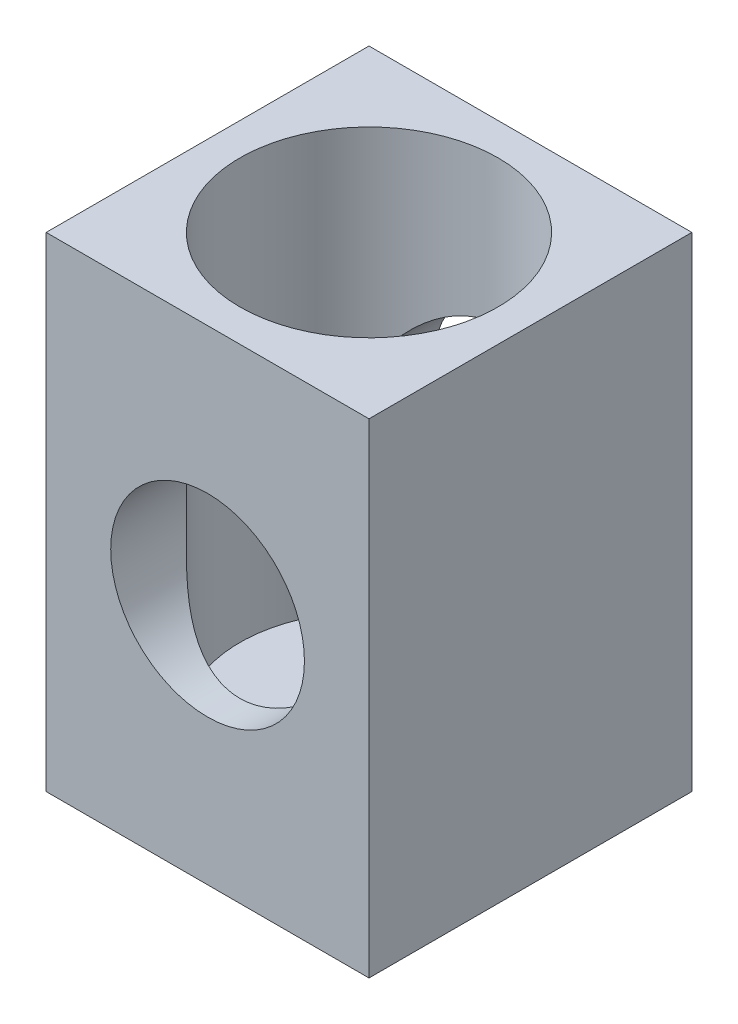
ISO-10303-21;
HEADER;
FILE_DESCRIPTION(('STEP AP214'),'2;1');
FILE_NAME('part.step','',(''),(''),'','','');
FILE_SCHEMA(('AUTOMOTIVE_DESIGN { 1 0 10303 214 1 1 1 1 }'));
ENDSEC;
DATA;
#1=APPLICATION_CONTEXT('core data for automotive mechanical design processes');
#2=APPLICATION_PROTOCOL_DEFINITION('international standard','automotive_design',2000,#1);
#3=PRODUCT_CONTEXT('',#1,'mechanical');
#4=PRODUCT('Part','Part','',(#3));
#5=PRODUCT_RELATED_PRODUCT_CATEGORY('part','',(#4));
#6=PRODUCT_DEFINITION_FORMATION('','',#4);
#7=PRODUCT_DEFINITION_CONTEXT('part definition',#1,'design');
#8=PRODUCT_DEFINITION('design','',#6,#7);
#9=PRODUCT_DEFINITION_SHAPE('','',#8);
#10=(LENGTH_UNIT() NAMED_UNIT(*) SI_UNIT(.MILLI.,.METRE.));
#11=(NAMED_UNIT(*) PLANE_ANGLE_UNIT() SI_UNIT($,.RADIAN.));
#12=(NAMED_UNIT(*) SI_UNIT($,.STERADIAN.) SOLID_ANGLE_UNIT());
#13=UNCERTAINTY_MEASURE_WITH_UNIT(LENGTH_MEASURE(1.E-05),#10,'distance_accuracy_value','');
#14=(GEOMETRIC_REPRESENTATION_CONTEXT(3) GLOBAL_UNCERTAINTY_ASSIGNED_CONTEXT((#13)) GLOBAL_UNIT_ASSIGNED_CONTEXT((#10,
#11,#12)) REPRESENTATION_CONTEXT('',''));
#15=CARTESIAN_POINT('',(0.,0.,0.));
#16=DIRECTION('',(0.,0.,1.));
#17=DIRECTION('',(1.,0.,0.));
#18=AXIS2_PLACEMENT_3D('',#15,#16,#17);
#19=CARTESIAN_POINT('',(0.,0.,10.));
#20=DIRECTION('',(0.,0.,-1.));
#21=DIRECTION('',(-1.,0.,0.));
#22=AXIS2_PLACEMENT_3D('',#19,#20,#21);
#23=CYLINDRICAL_SURFACE('',#22,3.);
#24=CARTESIAN_POINT('',(-3.,0.,7.64575131106459));
#25=CARTESIAN_POINT('',(-3.00000280896557,-0.0700400109545899,7.645745510217));
#26=CARTESIAN_POINT('',(-2.99754094962657,-0.140057631563114,7.64854755685349));
#27=CARTESIAN_POINT('',(-2.98778335234161,-0.279338367039745,7.65954937326353));
#28=CARTESIAN_POINT('',(-2.98048600162194,-0.348601222335317,7.6677509439258));
#29=CARTESIAN_POINT('',(-2.95155901854998,-0.554512621260734,7.69984445943127));
#30=CARTESIAN_POINT('',(-2.92289529116371,-0.689073945480057,7.7312230381533));
#31=CARTESIAN_POINT('',(-2.84967902852603,-0.947198100722388,7.80749414131084));
#32=CARTESIAN_POINT('',(-2.80535116546462,-1.0708870623472,7.85219424245675));
#33=CARTESIAN_POINT('',(-2.70261160960258,-1.30868140121693,7.94973182273596));
#34=CARTESIAN_POINT('',(-2.64420161900243,-1.42278793450775,8.0025683180905));
#35=CARTESIAN_POINT('',(-2.50080271595863,-1.66422514565906,8.12354326851478));
#36=CARTESIAN_POINT('',(-2.41280926238806,-1.78931998588241,8.19256884637289));
#37=CARTESIAN_POINT('',(-2.2186541254275,-2.02506683861348,8.33043252944683));
#38=CARTESIAN_POINT('',(-2.11246568694301,-2.13569715304193,8.3992702047211));
#39=CARTESIAN_POINT('',(-1.92836490190184,-2.30000310928588,8.50539769561968));
#40=CARTESIAN_POINT('',(-1.85597029075026,-2.35884951415949,8.54435965000119));
#41=CARTESIAN_POINT('',(-1.70504181430757,-2.47014549419953,8.6193818859952));
#42=CARTESIAN_POINT('',(-1.62651080993558,-2.52259802147264,8.6554435040806));
#43=CARTESIAN_POINT('',(-1.46370409108269,-2.62041392728754,8.72361957309374));
#44=CARTESIAN_POINT('',(-1.37943756818546,-2.66578828201937,8.75574011862965));
#45=CARTESIAN_POINT('',(-1.20559494807532,-2.74878528245246,8.81509912700353));
#46=CARTESIAN_POINT('',(-1.11602169211667,-2.78641202882129,8.84234017147395));
#47=CARTESIAN_POINT('',(-0.895799479373822,-2.86637910974201,8.90065407398259));
#48=CARTESIAN_POINT('',(-0.762908554560546,-2.90470447870669,8.92898588633408));
#49=CARTESIAN_POINT('',(-0.491088777779693,-2.96278993678961,8.97212104358515));
#50=CARTESIAN_POINT('',(-0.352165281713008,-2.9825661555359,8.98693614179333));
#51=CARTESIAN_POINT('',(-0.0717346069513397,-3.00244085765562,9.00182527262811));
#52=CARTESIAN_POINT('',(0.0697783346711364,-3.00248821011103,9.00186100185061));
#53=CARTESIAN_POINT('',(0.350633497188309,-2.98276482524305,8.9870847294994));
#54=CARTESIAN_POINT('',(0.489975207798217,-2.96298949844351,8.97226928948599));
#55=CARTESIAN_POINT('',(0.757778086122695,-2.90583772087129,8.92982740624245));
#56=CARTESIAN_POINT('',(0.886448455408856,-2.86908729937515,8.90265711426681));
#57=CARTESIAN_POINT('',(1.13536105117422,-2.78000876349667,8.83764561419608));
#58=CARTESIAN_POINT('',(1.25560143283418,-2.72767725241249,8.79980207941239));
#59=CARTESIAN_POINT('',(1.49843381849743,-2.60294075481544,8.7112209069133));
#60=CARTESIAN_POINT('',(1.61987076262548,-2.52897580274821,8.65953080871578));
#61=CARTESIAN_POINT('',(1.84913450790411,-2.36653259607667,8.54921405312389));
#62=CARTESIAN_POINT('',(1.95694957120903,-2.27804197375845,8.49058149661275));
#63=CARTESIAN_POINT('',(2.17816408331313,-2.06955330097201,8.35787531624607));
#64=CARTESIAN_POINT('',(2.28848985950528,-1.94678157961134,8.28303311698989));
#65=CARTESIAN_POINT('',(2.48801751171524,-1.68433083309214,8.13451916601302));
#66=CARTESIAN_POINT('',(2.57720932423716,-1.54464380090688,8.06084798741906));
#67=CARTESIAN_POINT('',(2.71746412822589,-1.27803625954326,7.93638851986388));
#68=CARTESIAN_POINT('',(2.77257733772077,-1.15402590973979,7.88395199558713));
#69=CARTESIAN_POINT('',(2.86638794181777,-0.895869436820915,7.79073482535992));
#70=CARTESIAN_POINT('',(2.90512243472909,-0.7617470392939,7.74992790713867));
#71=CARTESIAN_POINT('',(2.95804770816485,-0.512626113066036,7.69280101182057));
#72=CARTESIAN_POINT('',(2.97558139385094,-0.399105839376981,7.67323078916896));
#73=CARTESIAN_POINT('',(2.9974352084815,-0.169289064046268,7.6487117707326));
#74=CARTESIAN_POINT('',(3.00177224296671,-0.0529963068392494,7.64374426844221));
#75=CARTESIAN_POINT('',(2.99690541681497,0.178957970106776,7.64925736853119));
#76=CARTESIAN_POINT('',(2.98769657209908,0.29461924177816,7.6597436569903));
#77=CARTESIAN_POINT('',(2.95645049123765,0.522152354812109,7.6944244027003));
#78=CARTESIAN_POINT('',(2.93439135868922,0.634017382366582,7.71864225613374));
#79=CARTESIAN_POINT('',(2.86827946945848,0.892675833612172,7.78855502614561));
#80=CARTESIAN_POINT('',(2.81908501412404,1.03687078522466,7.83889586236445));
#81=CARTESIAN_POINT('',(2.7017763357747,1.31261645196258,7.95075783431285));
#82=CARTESIAN_POINT('',(2.6336272774567,1.44414328026578,8.01229948253767));
#83=CARTESIAN_POINT('',(2.47740025533046,1.69869361959231,8.14216325235085));
#84=CARTESIAN_POINT('',(2.38870032302784,1.82124906005961,8.21064858311596));
#85=CARTESIAN_POINT('',(2.19363312764518,2.05202089322889,8.34695922368102));
#86=CARTESIAN_POINT('',(2.08725728128943,2.16023027348304,8.41478419579483));
#87=CARTESIAN_POINT('',(1.90239818691815,2.32153213165692,8.51957077757728));
#88=CARTESIAN_POINT('',(1.82922305125998,2.37965811952592,8.55825033527664));
#89=CARTESIAN_POINT('',(1.67675777822378,2.48943814432249,8.63258399954074));
#90=CARTESIAN_POINT('',(1.59747053828961,2.54109521772846,8.66823952301725));
#91=CARTESIAN_POINT('',(1.43317795543371,2.63724136264881,8.73548722322448));
#92=CARTESIAN_POINT('',(1.34818053963821,2.68174009166811,8.76708486273611));
#93=CARTESIAN_POINT('',(1.17294532822089,2.76288334375196,8.8252747409515));
#94=CARTESIAN_POINT('',(1.08271039442741,2.7995321057078,8.85186968010572));
#95=CARTESIAN_POINT('',(0.861573588365201,2.87683946411381,8.90835673615322));
#96=CARTESIAN_POINT('',(0.7285167929003,2.91350380472521,8.93550115203699));
#97=CARTESIAN_POINT('',(0.45671226662122,2.96826736567963,8.97621371280714));
#98=CARTESIAN_POINT('',(0.317969739628316,2.98638318445571,8.98979399550191));
#99=CARTESIAN_POINT('',(0.0382996918456445,3.00303015435829,9.0022690757003));
#100=CARTESIAN_POINT('',(-0.102632185789823,3.00151533129432,9.00112939966075));
#101=CARTESIAN_POINT('',(-0.382019221764031,2.97887872098709,8.98417666975469));
#102=CARTESIAN_POINT('',(-0.520473710285136,2.9577517104191,8.96835970687872));
#103=CARTESIAN_POINT('',(-0.787043562612924,2.89804998722627,8.92406786315679));
#104=CARTESIAN_POINT('',(-0.915342390371109,2.8599995894081,8.89597377375742));
#105=CARTESIAN_POINT('',(-1.16332276886423,2.76842391672119,8.82925445361189));
#106=CARTESIAN_POINT('',(-1.28300246946203,2.71489533167846,8.7906269702888));
#107=CARTESIAN_POINT('',(-1.52509537227955,2.58744411218317,8.70035282969445));
#108=CARTESIAN_POINT('',(-1.64628246914877,2.51189814336096,8.64772704497864));
#109=CARTESIAN_POINT('',(-1.87482962773044,2.34626711280584,8.53571013069578));
#110=CARTESIAN_POINT('',(-1.98217681660196,2.25616868842546,8.47631279811072));
#111=CARTESIAN_POINT('',(-2.2022476229936,2.04398931120082,8.34212703425336));
#112=CARTESIAN_POINT('',(-2.31183387997298,1.91910738721412,8.26661834639247));
#113=CARTESIAN_POINT('',(-2.50950501943596,1.65226367003828,8.11732175300604));
#114=CARTESIAN_POINT('',(-2.59758202428158,1.51029564749765,8.04353448686307));
#115=CARTESIAN_POINT('',(-2.73391957253569,1.24223404800787,7.92099172443149));
#116=CARTESIAN_POINT('',(-2.78667101930056,1.11933187972561,7.87027147723428));
#117=CARTESIAN_POINT('',(-2.87610746935094,0.863832333692763,7.78065231320265));
#118=CARTESIAN_POINT('',(-2.91283513703737,0.731261812136979,7.74172209031511));
#119=CARTESIAN_POINT('',(-2.95994243938014,0.498428371532329,7.69064580071015));
#120=CARTESIAN_POINT('',(-2.97488911938737,0.400081361304646,7.67399401036027));
#121=CARTESIAN_POINT('',(-2.99491264524008,0.201139840614341,7.65155449367015));
#122=CARTESIAN_POINT('',(-2.99999596755293,0.100546848833889,7.64575963854681));
#123=CARTESIAN_POINT('',(-3.,0.,7.64575131106459));
#124=B_SPLINE_CURVE_WITH_KNOTS('',3,(#24,#25,#26,#27,#28,#29,#30,#31,#32,#33,#34,#35,#36,#37,
#38,#39,#40,#41,#42,#43,#44,#45,#46,#47,#48,#49,#50,#51,#52,#53,#54,#55,#56,#57,#58,#59,#60,#61,
#62,#63,#64,#65,#66,#67,#68,#69,#70,#71,#72,#73,#74,#75,#76,#77,#78,#79,#80,#81,#82,#83,#84,#85,
#86,#87,#88,#89,#90,#91,#92,#93,#94,#95,#96,#97,#98,#99,#100,#101,#102,#103,#104,#105,#106,#107,
#108,#109,#110,#111,#112,#113,#114,#115,#116,#117,#118,#119,#120,#121,#122,#123),.UNSPECIFIED.,
.T.,.F.,(4,2,2,2,2,2,2,2,2,2,2,2,2,2,2,2,2,2,2,2,2,2,2,2,2,2,2,2,2,2,2,2,2,2,2,2,2,2,2,2,2,2,2,
2,2,2,2,2,2,4),(0.,0.209978661686243,0.420027392494301,0.840743284291309,1.2556546103656,
1.67051580847001,2.1722680129487,2.6747644597623,2.97770625271006,3.28050764081971,
3.58283470135667,3.88500133203435,4.30659768868619,4.7278271005493,5.15014819769122,
5.57256709596085,5.98051830103609,6.38855850530847,6.84078006547298,7.29338868088834,
7.83503352722912,8.37693577609374,8.81203137267901,9.2461361153952,9.5942032940531,
9.94182439389894,10.2895734296593,10.6379167570555,11.116643747183,11.5962564359181,
12.0929073649363,12.5898001720674,12.8928465253493,13.1957500925974,13.4982415141315,
13.8005691796994,14.2206053318566,14.6402652787517,15.0609082299889,15.4816632434469,
15.8902036618063,16.2988315155547,16.7537484577603,17.2090855228609,17.7544990195312,
18.3001119721387,18.7279130007848,19.154567923422,19.4562036495329,19.7576412488016),.UNSPECIFIED.);
#125=CARTESIAN_POINT('',(-3.,0.,7.64575131106459));
#126=VERTEX_POINT('',#125);
#127=EDGE_CURVE('E43',#126,#126,#124,.T.);
#128=ORIENTED_EDGE('',*,*,#127,.F.);
#129=EDGE_LOOP('',(#128));
#130=FACE_BOUND('',#129,.T.);
#131=CARTESIAN_POINT('',(0.,0.,10.));
#132=DIRECTION('',(0.,0.,1.));
#133=DIRECTION('',(1.,0.,0.));
#134=AXIS2_PLACEMENT_3D('',#131,#132,#133);
#135=CIRCLE('',#134,3.);
#136=CARTESIAN_POINT('',(3.,0.,10.));
#137=VERTEX_POINT('',#136);
#138=EDGE_CURVE('E121',#137,#137,#135,.T.);
#139=ORIENTED_EDGE('',*,*,#138,.T.);
#140=EDGE_LOOP('',(#139));
#141=FACE_BOUND('',#140,.T.);
#142=ADVANCED_FACE('F39',(#130,#141),#23,.F.);
#143=CARTESIAN_POINT('',(0.,0.,10.));
#144=DIRECTION('',(0.,0.,-1.));
#145=DIRECTION('',(-1.,0.,0.));
#146=AXIS2_PLACEMENT_3D('',#143,#144,#145);
#147=PLANE('',#146);
#148=DIRECTION('',(0.,1.,0.));
#149=VECTOR('',#148,1.);
#150=CARTESIAN_POINT('',(5.,-7.5,10.));
#151=LINE('',#150,#149);
#152=CARTESIAN_POINT('',(5.,-7.5,10.));
#153=VERTEX_POINT('',#152);
#154=CARTESIAN_POINT('',(5.,7.5,10.));
#155=VERTEX_POINT('',#154);
#156=EDGE_CURVE('E100',#153,#155,#151,.T.);
#157=ORIENTED_EDGE('',*,*,#156,.T.);
#158=DIRECTION('',(-1.,0.,0.));
#159=VECTOR('',#158,1.);
#160=CARTESIAN_POINT('',(-5.,7.5,10.));
#161=LINE('',#160,#159);
#162=CARTESIAN_POINT('',(-5.,7.5,10.));
#163=VERTEX_POINT('',#162);
#164=EDGE_CURVE('E94',#155,#163,#161,.T.);
#165=ORIENTED_EDGE('',*,*,#164,.T.);
#166=DIRECTION('',(0.,-1.,0.));
#167=VECTOR('',#166,1.);
#168=CARTESIAN_POINT('',(-5.,-7.5,10.));
#169=LINE('',#168,#167);
#170=CARTESIAN_POINT('',(-5.,-7.5,10.));
#171=VERTEX_POINT('',#170);
#172=EDGE_CURVE('E98',#163,#171,#169,.T.);
#173=ORIENTED_EDGE('',*,*,#172,.T.);
#174=DIRECTION('',(1.,0.,0.));
#175=VECTOR('',#174,1.);
#176=CARTESIAN_POINT('',(-5.,-7.5,10.));
#177=LINE('',#176,#175);
#178=EDGE_CURVE('E64',#171,#153,#177,.T.);
#179=ORIENTED_EDGE('',*,*,#178,.T.);
#180=EDGE_LOOP('',(#157,#165,#173,#179));
#181=FACE_BOUND('',#180,.T.);
#182=ORIENTED_EDGE('',*,*,#138,.F.);
#183=EDGE_LOOP('',(#182));
#184=FACE_BOUND('',#183,.T.);
#185=ADVANCED_FACE('F95',(#181,#184),#147,.F.);
#186=CARTESIAN_POINT('',(0.,0.,0.));
#187=DIRECTION('',(0.,0.,-1.));
#188=DIRECTION('',(-1.,0.,0.));
#189=AXIS2_PLACEMENT_3D('',#186,#187,#188);
#190=PLANE('',#189);
#191=DIRECTION('',(0.,1.,0.));
#192=VECTOR('',#191,1.);
#193=CARTESIAN_POINT('',(5.,-7.5,0.));
#194=LINE('',#193,#192);
#195=CARTESIAN_POINT('',(5.,-7.5,0.));
#196=VERTEX_POINT('',#195);
#197=CARTESIAN_POINT('',(5.,7.5,0.));
#198=VERTEX_POINT('',#197);
#199=EDGE_CURVE('E117',#196,#198,#194,.T.);
#200=ORIENTED_EDGE('',*,*,#199,.F.);
#201=DIRECTION('',(1.,0.,0.));
#202=VECTOR('',#201,1.);
#203=CARTESIAN_POINT('',(-5.,-7.5,0.));
#204=LINE('',#203,#202);
#205=CARTESIAN_POINT('',(-5.,-7.5,0.));
#206=VERTEX_POINT('',#205);
#207=EDGE_CURVE('E87',#206,#196,#204,.T.);
#208=ORIENTED_EDGE('',*,*,#207,.F.);
#209=DIRECTION('',(0.,-1.,0.));
#210=VECTOR('',#209,1.);
#211=CARTESIAN_POINT('',(-5.,-7.5,0.));
#212=LINE('',#211,#210);
#213=CARTESIAN_POINT('',(-5.,7.5,0.));
#214=VERTEX_POINT('',#213);
#215=EDGE_CURVE('E81',#214,#206,#212,.T.);
#216=ORIENTED_EDGE('',*,*,#215,.F.);
#217=DIRECTION('',(-1.,0.,0.));
#218=VECTOR('',#217,1.);
#219=CARTESIAN_POINT('',(-5.,7.5,0.));
#220=LINE('',#219,#218);
#221=EDGE_CURVE('E105',#198,#214,#220,.T.);
#222=ORIENTED_EDGE('',*,*,#221,.F.);
#223=EDGE_LOOP('',(#200,#208,#216,#222));
#224=FACE_BOUND('',#223,.T.);
#225=CARTESIAN_POINT('',(0.,0.,0.));
#226=DIRECTION('',(0.,0.,1.));
#227=DIRECTION('',(1.,0.,0.));
#228=AXIS2_PLACEMENT_3D('',#225,#226,#227);
#229=CIRCLE('',#228,3.);
#230=CARTESIAN_POINT('',(3.,0.,0.));
#231=VERTEX_POINT('',#230);
#232=EDGE_CURVE('E172',#231,#231,#229,.T.);
#233=ORIENTED_EDGE('',*,*,#232,.T.);
#234=EDGE_LOOP('',(#233));
#235=FACE_BOUND('',#234,.T.);
#236=ADVANCED_FACE('F158',(#224,#235),#190,.T.);
#237=CARTESIAN_POINT('',(5.,-7.5,10.));
#238=DIRECTION('',(-1.,0.,0.));
#239=DIRECTION('',(0.,0.,1.));
#240=AXIS2_PLACEMENT_3D('',#237,#238,#239);
#241=PLANE('',#240);
#242=ORIENTED_EDGE('',*,*,#199,.T.);
#243=DIRECTION('',(0.,0.,-1.));
#244=VECTOR('',#243,1.);
#245=CARTESIAN_POINT('',(5.,7.5,10.));
#246=LINE('',#245,#244);
#247=EDGE_CURVE('E11',#155,#198,#246,.T.);
#248=ORIENTED_EDGE('',*,*,#247,.F.);
#249=ORIENTED_EDGE('',*,*,#156,.F.);
#250=DIRECTION('',(0.,0.,-1.));
#251=VECTOR('',#250,1.);
#252=CARTESIAN_POINT('',(5.,-7.5,10.));
#253=LINE('',#252,#251);
#254=EDGE_CURVE('E113',#153,#196,#253,.T.);
#255=ORIENTED_EDGE('',*,*,#254,.T.);
#256=EDGE_LOOP('',(#242,#248,#249,#255));
#257=FACE_BOUND('',#256,.T.);
#258=ADVANCED_FACE('F41',(#257),#241,.F.);
#259=CARTESIAN_POINT('',(-5.,7.5,10.));
#260=DIRECTION('',(0.,-1.,0.));
#261=DIRECTION('',(0.,0.,-1.));
#262=AXIS2_PLACEMENT_3D('',#259,#260,#261);
#263=PLANE('',#262);
#264=CARTESIAN_POINT('',(0.,7.5,5.));
#265=DIRECTION('',(0.,1.,0.));
#266=DIRECTION('',(0.,0.,1.));
#267=AXIS2_PLACEMENT_3D('',#264,#265,#266);
#268=CIRCLE('',#267,4.);
#269=CARTESIAN_POINT('',(0.,7.5,9.));
#270=VERTEX_POINT('',#269);
#271=EDGE_CURVE('E183',#270,#270,#268,.T.);
#272=ORIENTED_EDGE('',*,*,#271,.F.);
#273=EDGE_LOOP('',(#272));
#274=FACE_BOUND('',#273,.T.);
#275=ORIENTED_EDGE('',*,*,#221,.T.);
#276=DIRECTION('',(0.,0.,-1.));
#277=VECTOR('',#276,1.);
#278=CARTESIAN_POINT('',(-5.,7.5,10.));
#279=LINE('',#278,#277);
#280=EDGE_CURVE('E55',#163,#214,#279,.T.);
#281=ORIENTED_EDGE('',*,*,#280,.F.);
#282=ORIENTED_EDGE('',*,*,#164,.F.);
#283=ORIENTED_EDGE('',*,*,#247,.T.);
#284=EDGE_LOOP('',(#275,#281,#282,#283));
#285=FACE_BOUND('',#284,.T.);
#286=ADVANCED_FACE('F104',(#274,#285),#263,.F.);
#287=CARTESIAN_POINT('',(-5.,-7.5,10.));
#288=DIRECTION('',(1.,0.,0.));
#289=DIRECTION('',(0.,0.,-1.));
#290=AXIS2_PLACEMENT_3D('',#287,#288,#289);
#291=PLANE('',#290);
#292=ORIENTED_EDGE('',*,*,#215,.T.);
#293=DIRECTION('',(0.,0.,-1.));
#294=VECTOR('',#293,1.);
#295=CARTESIAN_POINT('',(-5.,-7.5,10.));
#296=LINE('',#295,#294);
#297=EDGE_CURVE('E107',#171,#206,#296,.T.);
#298=ORIENTED_EDGE('',*,*,#297,.F.);
#299=ORIENTED_EDGE('',*,*,#172,.F.);
#300=ORIENTED_EDGE('',*,*,#280,.T.);
#301=EDGE_LOOP('',(#292,#298,#299,#300));
#302=FACE_BOUND('',#301,.T.);
#303=ADVANCED_FACE('F109',(#302),#291,.F.);
#304=CARTESIAN_POINT('',(-5.,-7.5,10.));
#305=DIRECTION('',(0.,1.,0.));
#306=DIRECTION('',(0.,0.,1.));
#307=AXIS2_PLACEMENT_3D('',#304,#305,#306);
#308=PLANE('',#307);
#309=ORIENTED_EDGE('',*,*,#207,.T.);
#310=ORIENTED_EDGE('',*,*,#254,.F.);
#311=ORIENTED_EDGE('',*,*,#178,.F.);
#312=ORIENTED_EDGE('',*,*,#297,.T.);
#313=EDGE_LOOP('',(#309,#310,#311,#312));
#314=FACE_BOUND('',#313,.T.);
#315=ADVANCED_FACE('F162',(#314),#308,.F.);
#316=CARTESIAN_POINT('',(-3.,0.,2.35424868893541));
#317=CARTESIAN_POINT('',(-3.00000280896557,0.0700400109545969,2.354254489783));
#318=CARTESIAN_POINT('',(-2.99754094962657,0.140057631563121,2.3514524431465));
#319=CARTESIAN_POINT('',(-2.98778335234161,0.279338367039752,2.34045062673647));
#320=CARTESIAN_POINT('',(-2.98048600162194,0.348601222335324,2.3322490560742));
#321=CARTESIAN_POINT('',(-2.95155901854998,0.554512621260741,2.30015554056873));
#322=CARTESIAN_POINT('',(-2.92289529116371,0.689073945480064,2.2687769618467));
#323=CARTESIAN_POINT('',(-2.84967902852603,0.947198100722395,2.19250585868916));
#324=CARTESIAN_POINT('',(-2.80535116546462,1.0708870623472,2.14780575754325));
#325=CARTESIAN_POINT('',(-2.70261160960258,1.30868140121694,2.05026817726404));
#326=CARTESIAN_POINT('',(-2.64420161900243,1.42278793450776,1.9974316819095));
#327=CARTESIAN_POINT('',(-2.50080271595863,1.66422514565907,1.87645673148522));
#328=CARTESIAN_POINT('',(-2.41280926238807,1.78931998588242,1.80743115362711));
#329=CARTESIAN_POINT('',(-2.2186541254275,2.02506683861348,1.66956747055317));
#330=CARTESIAN_POINT('',(-2.11246568694301,2.13569715304193,1.6007297952789));
#331=CARTESIAN_POINT('',(-1.92836490190184,2.30000310928589,1.49460230438032));
#332=CARTESIAN_POINT('',(-1.85597029075026,2.3588495141595,1.45564034999881));
#333=CARTESIAN_POINT('',(-1.70504181430758,2.47014549419954,1.3806181140048));
#334=CARTESIAN_POINT('',(-1.62651080993558,2.52259802147264,1.3445564959194));
#335=CARTESIAN_POINT('',(-1.4637040910827,2.62041392728754,1.27638042690626));
#336=CARTESIAN_POINT('',(-1.37943756818546,2.66578828201937,1.24425988137035));
#337=CARTESIAN_POINT('',(-1.20559494807532,2.74878528245246,1.18490087299647));
#338=CARTESIAN_POINT('',(-1.11602169211667,2.7864120288213,1.15765982852605));
#339=CARTESIAN_POINT('',(-0.895799479373825,2.86637910974202,1.09934592601741));
#340=CARTESIAN_POINT('',(-0.762908554560549,2.9047044787067,1.07101411366593));
#341=CARTESIAN_POINT('',(-0.491088777779695,2.96278993678962,1.02787895641485));
#342=CARTESIAN_POINT('',(-0.35216528171301,2.98256615553591,1.01306385820667));
#343=CARTESIAN_POINT('',(-0.0717346069513414,3.00244085765563,0.99817472737189));
#344=CARTESIAN_POINT('',(0.0697783346711349,3.00248821011104,0.998138998149389));
#345=CARTESIAN_POINT('',(0.350633497188308,2.98276482524306,1.0129152705006));
#346=CARTESIAN_POINT('',(0.489975207798216,2.96298949844352,1.02773071051401));
#347=CARTESIAN_POINT('',(0.757778086122695,2.90583772087129,1.07017259375755));
#348=CARTESIAN_POINT('',(0.886448455408856,2.86908729937515,1.09734288573319));
#349=CARTESIAN_POINT('',(1.13536105117422,2.78000876349667,1.16235438580392));
#350=CARTESIAN_POINT('',(1.25560143283418,2.7276772524125,1.20019792058761));
#351=CARTESIAN_POINT('',(1.49843381849743,2.60294075481545,1.2887790930867));
#352=CARTESIAN_POINT('',(1.61987076262548,2.52897580274822,1.34046919128422));
#353=CARTESIAN_POINT('',(1.84913450790411,2.36653259607668,1.45078594687611));
#354=CARTESIAN_POINT('',(1.95694957120903,2.27804197375846,1.50941850338725));
#355=CARTESIAN_POINT('',(2.17816408331313,2.06955330097202,1.64212468375393));
#356=CARTESIAN_POINT('',(2.28848985950528,1.94678157961134,1.71696688301011));
#357=CARTESIAN_POINT('',(2.48801751171524,1.68433083309214,1.86548083398698));
#358=CARTESIAN_POINT('',(2.57720932423716,1.54464380090689,1.93915201258094));
#359=CARTESIAN_POINT('',(2.71746412822589,1.27803625954327,2.06361148013612));
#360=CARTESIAN_POINT('',(2.77257733772077,1.1540259097398,2.11604800441288));
#361=CARTESIAN_POINT('',(2.86638794181777,0.895869436820922,2.20926517464008));
#362=CARTESIAN_POINT('',(2.90512243472909,0.761747039293907,2.25007209286133));
#363=CARTESIAN_POINT('',(2.95804770816485,0.512626113066044,2.30719898817943));
#364=CARTESIAN_POINT('',(2.97558139385094,0.39910583937699,2.32676921083104));
#365=CARTESIAN_POINT('',(2.9974352084815,0.169289064046277,2.3512882292674));
#366=CARTESIAN_POINT('',(3.00177224296671,0.0529963068392576,2.35625573155779));
#367=CARTESIAN_POINT('',(2.99690541681497,-0.178957970106769,2.3507426314688));
#368=CARTESIAN_POINT('',(2.98769657209908,-0.294619241778153,2.3402563430097));
#369=CARTESIAN_POINT('',(2.95645049123765,-0.522152354812102,2.3055755972997));
#370=CARTESIAN_POINT('',(2.93439135868922,-0.634017382366575,2.28135774386626));
#371=CARTESIAN_POINT('',(2.86827946945848,-0.892675833612164,2.21144497385439));
#372=CARTESIAN_POINT('',(2.81908501412404,-1.03687078522465,2.16110413763555));
#373=CARTESIAN_POINT('',(2.7017763357747,-1.31261645196257,2.04924216568715));
#374=CARTESIAN_POINT('',(2.6336272774567,-1.44414328026577,1.98770051746234));
#375=CARTESIAN_POINT('',(2.47740025533046,-1.69869361959231,1.85783674764915));
#376=CARTESIAN_POINT('',(2.38870032302784,-1.8212490600596,1.78935141688404));
#377=CARTESIAN_POINT('',(2.19363312764518,-2.05202089322888,1.65304077631898));
#378=CARTESIAN_POINT('',(2.08725728128943,-2.16023027348303,1.58521580420517));
#379=CARTESIAN_POINT('',(1.90239818691815,-2.32153213165691,1.48042922242272));
#380=CARTESIAN_POINT('',(1.82922305125998,-2.37965811952591,1.44174966472335));
#381=CARTESIAN_POINT('',(1.67675777822378,-2.48943814432249,1.36741600045926));
#382=CARTESIAN_POINT('',(1.59747053828961,-2.54109521772846,1.33176047698275));
#383=CARTESIAN_POINT('',(1.43317795543371,-2.63724136264881,1.26451277677552));
#384=CARTESIAN_POINT('',(1.34818053963821,-2.68174009166811,1.23291513726389));
#385=CARTESIAN_POINT('',(1.17294532822089,-2.76288334375196,1.1747252590485));
#386=CARTESIAN_POINT('',(1.08271039442741,-2.79953210570779,1.14813031989428));
#387=CARTESIAN_POINT('',(0.861573588365199,-2.87683946411381,1.09164326384678));
#388=CARTESIAN_POINT('',(0.728516792900298,-2.91350380472521,1.06449884796301));
#389=CARTESIAN_POINT('',(0.456712266621219,-2.96826736567962,1.02378628719286));
#390=CARTESIAN_POINT('',(0.317969739628315,-2.98638318445571,1.01020600449809));
#391=CARTESIAN_POINT('',(0.0382996918456428,-3.00303015435829,0.9977309242997));
#392=CARTESIAN_POINT('',(-0.102632185789825,-3.00151533129432,0.998870600339251));
#393=CARTESIAN_POINT('',(-0.382019221764032,-2.97887872098708,1.01582333024531));
#394=CARTESIAN_POINT('',(-0.520473710285136,-2.95775171041909,1.03164029312128));
#395=CARTESIAN_POINT('',(-0.787043562612926,-2.89804998722626,1.07593213684321));
#396=CARTESIAN_POINT('',(-0.915342390371111,-2.85999958940809,1.10402622624258));
#397=CARTESIAN_POINT('',(-1.16332276886424,-2.76842391672118,1.17074554638811));
#398=CARTESIAN_POINT('',(-1.28300246946203,-2.71489533167845,1.2093730297112));
#399=CARTESIAN_POINT('',(-1.52509537227955,-2.58744411218316,1.29964717030555));
#400=CARTESIAN_POINT('',(-1.64628246914877,-2.51189814336095,1.35227295502136));
#401=CARTESIAN_POINT('',(-1.87482962773044,-2.34626711280583,1.46428986930422));
#402=CARTESIAN_POINT('',(-1.98217681660196,-2.25616868842546,1.52368720188928));
#403=CARTESIAN_POINT('',(-2.2022476229936,-2.04398931120081,1.65787296574664));
#404=CARTESIAN_POINT('',(-2.31183387997298,-1.91910738721411,1.73338165360753));
#405=CARTESIAN_POINT('',(-2.50950501943596,-1.65226367003828,1.88267824699396));
#406=CARTESIAN_POINT('',(-2.59758202428158,-1.51029564749764,1.95646551313693));
#407=CARTESIAN_POINT('',(-2.73391957253569,-1.24223404800786,2.07900827556851));
#408=CARTESIAN_POINT('',(-2.78667101930056,-1.1193318797256,2.12972852276572));
#409=CARTESIAN_POINT('',(-2.87610746935094,-0.863832333692756,2.21934768679736));
#410=CARTESIAN_POINT('',(-2.91283513703737,-0.731261812136972,2.25827790968489));
#411=CARTESIAN_POINT('',(-2.95994243938014,-0.498428371532321,2.30935419928985));
#412=CARTESIAN_POINT('',(-2.97488911938737,-0.400081361304637,2.32600598963973));
#413=CARTESIAN_POINT('',(-2.99491264524008,-0.201139840614331,2.34844550632985));
#414=CARTESIAN_POINT('',(-2.99999596755293,-0.100546848833881,2.35424036145319));
#415=CARTESIAN_POINT('',(-3.,0.,2.35424868893541));
#416=B_SPLINE_CURVE_WITH_KNOTS('',3,(#316,#317,#318,#319,#320,#321,#322,#323,#324,#325,#326,
#327,#328,#329,#330,#331,#332,#333,#334,#335,#336,#337,#338,#339,#340,#341,#342,#343,#344,#345,
#346,#347,#348,#349,#350,#351,#352,#353,#354,#355,#356,#357,#358,#359,#360,#361,#362,#363,#364,
#365,#366,#367,#368,#369,#370,#371,#372,#373,#374,#375,#376,#377,#378,#379,#380,#381,#382,#383,
#384,#385,#386,#387,#388,#389,#390,#391,#392,#393,#394,#395,#396,#397,#398,#399,#400,#401,#402,
#403,#404,#405,#406,#407,#408,#409,#410,#411,#412,#413,#414,#415),.UNSPECIFIED.,.T.,.F.,(4,2,2,
2,2,2,2,2,2,2,2,2,2,2,2,2,2,2,2,2,2,2,2,2,2,2,2,2,2,2,2,2,2,2,2,2,2,2,2,2,2,2,2,2,2,2,2,2,2,4),
(0.,0.209978661686243,0.420027392494301,0.840743284291309,1.2556546103656,1.67051580847001,
2.1722680129487,2.6747644597623,2.97770625271005,3.2805076408197,3.58283470135667,
3.88500133203435,4.30659768868618,4.7278271005493,5.15014819769121,5.57256709596085,
5.98051830103609,6.38855850530847,6.84078006547298,7.29338868088834,7.83503352722912,
8.37693577609374,8.81203137267901,9.2461361153952,9.5942032940531,9.94182439389894,
10.2895734296593,10.6379167570555,11.116643747183,11.5962564359181,12.0929073649363,
12.5898001720674,12.8928465253494,13.1957500925974,13.4982415141315,13.8005691796994,
14.2206053318566,14.6402652787517,15.0609082299889,15.4816632434469,15.8902036618063,
16.2988315155547,16.7537484577603,17.2090855228609,17.7544990195311,18.3001119721387,
18.7279130007848,19.154567923422,19.4562036495329,19.7576412488016),.UNSPECIFIED.);
#417=CARTESIAN_POINT('',(-3.,0.,2.35424868893541));
#418=VERTEX_POINT('',#417);
#419=EDGE_CURVE('E131',#418,#418,#416,.T.);
#420=ORIENTED_EDGE('',*,*,#419,.F.);
#421=EDGE_LOOP('',(#420));
#422=FACE_BOUND('',#421,.T.);
#423=ORIENTED_EDGE('',*,*,#232,.F.);
#424=EDGE_LOOP('',(#423));
#425=FACE_BOUND('',#424,.T.);
#426=ADVANCED_FACE('F138',(#422,#425),#23,.F.);
#427=CARTESIAN_POINT('',(0.,-5.5,5.));
#428=DIRECTION('',(0.,1.,0.));
#429=DIRECTION('',(0.,0.,1.));
#430=AXIS2_PLACEMENT_3D('',#427,#428,#429);
#431=CYLINDRICAL_SURFACE('',#430,4.);
#432=ORIENTED_EDGE('',*,*,#127,.T.);
#433=EDGE_LOOP('',(#432));
#434=FACE_BOUND('',#433,.T.);
#435=ORIENTED_EDGE('',*,*,#419,.T.);
#436=EDGE_LOOP('',(#435));
#437=FACE_BOUND('',#436,.T.);
#438=CARTESIAN_POINT('',(0.,-5.5,5.));
#439=DIRECTION('',(0.,1.,0.));
#440=DIRECTION('',(0.,0.,1.));
#441=AXIS2_PLACEMENT_3D('',#438,#439,#440);
#442=CIRCLE('',#441,4.);
#443=CARTESIAN_POINT('',(0.,-5.5,9.));
#444=VERTEX_POINT('',#443);
#445=EDGE_CURVE('E137',#444,#444,#442,.T.);
#446=ORIENTED_EDGE('',*,*,#445,.F.);
#447=EDGE_LOOP('',(#446));
#448=FACE_BOUND('',#447,.T.);
#449=ORIENTED_EDGE('',*,*,#271,.T.);
#450=EDGE_LOOP('',(#449));
#451=FACE_BOUND('',#450,.T.);
#452=ADVANCED_FACE('F141',(#434,#437,#448,#451),#431,.F.);
#453=CARTESIAN_POINT('',(0.,-5.5,5.));
#454=DIRECTION('',(0.,1.,0.));
#455=DIRECTION('',(0.,0.,1.));
#456=AXIS2_PLACEMENT_3D('',#453,#454,#455);
#457=PLANE('',#456);
#458=ORIENTED_EDGE('',*,*,#445,.T.);
#459=EDGE_LOOP('',(#458));
#460=FACE_BOUND('',#459,.T.);
#461=ADVANCED_FACE('F145',(#460),#457,.T.);
#462=CLOSED_SHELL('',(#142,#185,#236,#258,#286,#303,#315,#426,#452,#461));
#463=MANIFOLD_SOLID_BREP('B2',#462);
#464=ADVANCED_BREP_SHAPE_REPRESENTATION('',(#18,#463),#14);
#465=SHAPE_DEFINITION_REPRESENTATION(#9,#464);
ENDSEC;
END-ISO-10303-21;
